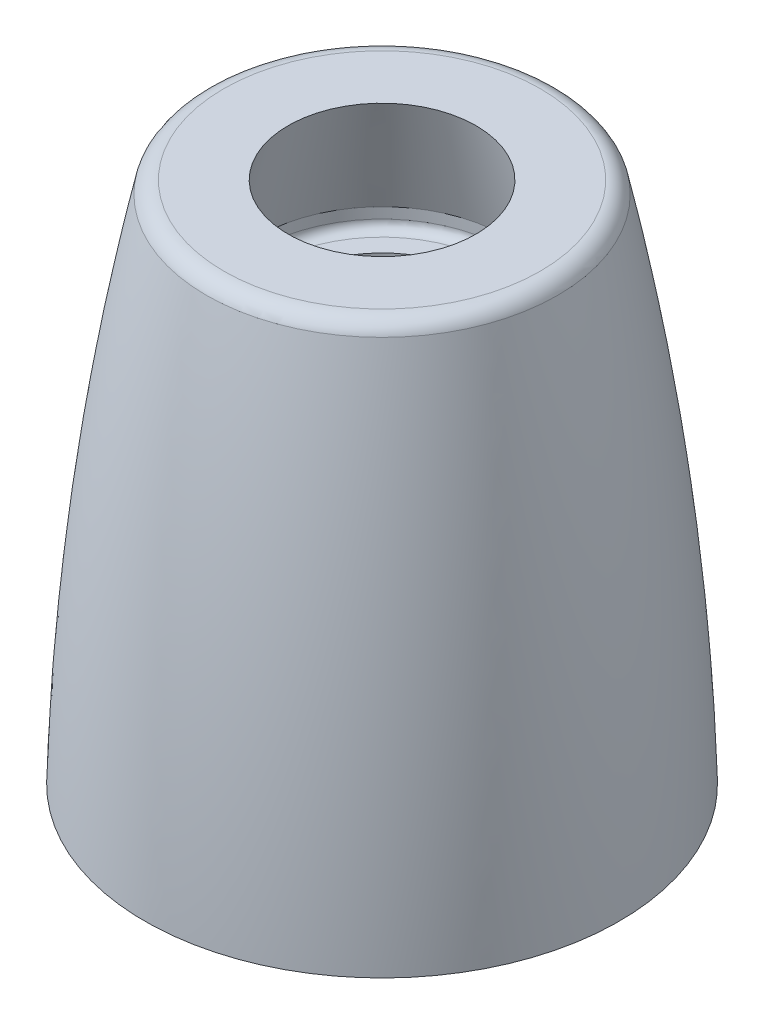
ISO-10303-21;
HEADER;
FILE_DESCRIPTION(('STEP AP214'),'2;1');
FILE_NAME('part.step','',(''),(''),'','','');
FILE_SCHEMA(('AUTOMOTIVE_DESIGN { 1 0 10303 214 1 1 1 1 }'));
ENDSEC;
DATA;
#1=APPLICATION_CONTEXT('core data for automotive mechanical design processes');
#2=APPLICATION_PROTOCOL_DEFINITION('international standard','automotive_design',2000,#1);
#3=PRODUCT_CONTEXT('',#1,'mechanical');
#4=PRODUCT('Part','Part','',(#3));
#5=PRODUCT_RELATED_PRODUCT_CATEGORY('part','',(#4));
#6=PRODUCT_DEFINITION_FORMATION('','',#4);
#7=PRODUCT_DEFINITION_CONTEXT('part definition',#1,'design');
#8=PRODUCT_DEFINITION('design','',#6,#7);
#9=PRODUCT_DEFINITION_SHAPE('','',#8);
#10=(LENGTH_UNIT() NAMED_UNIT(*) SI_UNIT(.MILLI.,.METRE.));
#11=(NAMED_UNIT(*) PLANE_ANGLE_UNIT() SI_UNIT($,.RADIAN.));
#12=(NAMED_UNIT(*) SI_UNIT($,.STERADIAN.) SOLID_ANGLE_UNIT());
#13=UNCERTAINTY_MEASURE_WITH_UNIT(LENGTH_MEASURE(1.E-05),#10,'distance_accuracy_value','');
#14=(GEOMETRIC_REPRESENTATION_CONTEXT(3) GLOBAL_UNCERTAINTY_ASSIGNED_CONTEXT((#13)) GLOBAL_UNIT_ASSIGNED_CONTEXT((#10,
#11,#12)) REPRESENTATION_CONTEXT('',''));
#15=CARTESIAN_POINT('',(0.,0.,0.));
#16=DIRECTION('',(0.,0.,1.));
#17=DIRECTION('',(1.,0.,0.));
#18=AXIS2_PLACEMENT_3D('',#15,#16,#17);
#19=CARTESIAN_POINT('',(6.23062,24.3246111856191,0.));
#20=DIRECTION('',(0.,1.,0.));
#21=DIRECTION('',(0.,0.,1.));
#22=AXIS2_PLACEMENT_3D('',#19,#20,#21);
#23=PLANE('',#22);
#24=CARTESIAN_POINT('',(0.,24.3246111856191,0.));
#25=DIRECTION('',(0.,-1.,0.));
#26=DIRECTION('',(0.,0.,-1.));
#27=AXIS2_PLACEMENT_3D('',#24,#25,#26);
#28=CIRCLE('',#27,6.23062);
#29=CARTESIAN_POINT('',(0.,24.3246111856191,6.23062));
#30=VERTEX_POINT('',#29);
#31=CARTESIAN_POINT('',(0.,24.3246111856191,-6.23062));
#32=VERTEX_POINT('',#31);
#33=EDGE_CURVE('E50',#30,#32,#28,.F.);
#34=ORIENTED_EDGE('',*,*,#33,.T.);
#35=CARTESIAN_POINT('',(0.,24.3246111856191,0.));
#36=DIRECTION('',(0.,-1.,0.));
#37=DIRECTION('',(0.,0.,1.));
#38=AXIS2_PLACEMENT_3D('',#35,#36,#37);
#39=CIRCLE('',#38,6.23062);
#40=EDGE_CURVE('E53',#32,#30,#39,.F.);
#41=ORIENTED_EDGE('',*,*,#40,.T.);
#42=EDGE_LOOP('',(#34,#41));
#43=FACE_BOUND('',#42,.T.);
#44=CARTESIAN_POINT('',(0.,24.3246111856191,0.));
#45=DIRECTION('',(0.,-1.,0.));
#46=DIRECTION('',(0.,0.,-1.));
#47=AXIS2_PLACEMENT_3D('',#44,#45,#46);
#48=CIRCLE('',#47,5.175);
#49=CARTESIAN_POINT('',(0.,24.3246111856191,-5.175));
#50=VERTEX_POINT('',#49);
#51=EDGE_CURVE('E58',#50,#50,#48,.T.);
#52=ORIENTED_EDGE('',*,*,#51,.T.);
#53=EDGE_LOOP('',(#52));
#54=FACE_BOUND('',#53,.T.);
#55=ADVANCED_FACE('F16',(#43,#54),#23,.T.);
#56=CARTESIAN_POINT('',(0.,24.8249911856191,0.));
#57=DIRECTION('',(0.,-1.,0.));
#58=DIRECTION('',(0.,0.,-1.));
#59=AXIS2_PLACEMENT_3D('',#56,#57,#58);
#60=TOROIDAL_SURFACE('',#59,6.23062,0.500380000000001);
#61=ORIENTED_EDGE('',*,*,#40,.F.);
#62=ORIENTED_EDGE('',*,*,#33,.F.);
#63=EDGE_LOOP('',(#61,#62));
#64=FACE_BOUND('',#63,.T.);
#65=CARTESIAN_POINT('',(0.,24.8249911856191,0.));
#66=DIRECTION('',(0.,-1.,0.));
#67=DIRECTION('',(0.,0.,-1.));
#68=AXIS2_PLACEMENT_3D('',#65,#66,#67);
#69=CIRCLE('',#68,6.731);
#70=CARTESIAN_POINT('',(0.,24.8249911856191,-6.731));
#71=VERTEX_POINT('',#70);
#72=EDGE_CURVE('E143',#71,#71,#69,.F.);
#73=ORIENTED_EDGE('',*,*,#72,.T.);
#74=EDGE_LOOP('',(#73));
#75=FACE_BOUND('',#74,.T.);
#76=ADVANCED_FACE('F61',(#64,#75),#60,.F.);
#77=CARTESIAN_POINT('',(0.,31.0037578537676,0.));
#78=DIRECTION('',(0.,-1.,0.));
#79=DIRECTION('',(0.,0.,-1.));
#80=AXIS2_PLACEMENT_3D('',#77,#78,#79);
#81=CYLINDRICAL_SURFACE('',#80,5.175);
#82=CARTESIAN_POINT('',(0.,15.7722628656191,0.));
#83=DIRECTION('',(0.,-1.,0.));
#84=DIRECTION('',(0.,0.,-1.));
#85=AXIS2_PLACEMENT_3D('',#82,#83,#84);
#86=CIRCLE('',#85,5.175);
#87=CARTESIAN_POINT('',(0.,15.7722628656191,-5.175));
#88=VERTEX_POINT('',#87);
#89=EDGE_CURVE('E142',#88,#88,#86,.F.);
#90=ORIENTED_EDGE('',*,*,#89,.F.);
#91=EDGE_LOOP('',(#90));
#92=FACE_BOUND('',#91,.T.);
#93=ORIENTED_EDGE('',*,*,#51,.F.);
#94=EDGE_LOOP('',(#93));
#95=FACE_BOUND('',#94,.T.);
#96=ADVANCED_FACE('F149',(#92,#95),#81,.F.);
#97=CARTESIAN_POINT('',(0.,31.0037578537676,0.));
#98=DIRECTION('',(0.,-1.,0.));
#99=DIRECTION('',(0.,0.,-1.));
#100=AXIS2_PLACEMENT_3D('',#97,#98,#99);
#101=CYLINDRICAL_SURFACE('',#100,6.731);
#102=ORIENTED_EDGE('',*,*,#72,.F.);
#103=EDGE_LOOP('',(#102));
#104=FACE_BOUND('',#103,.T.);
#105=CARTESIAN_POINT('',(0.,25.4097866327925,0.));
#106=DIRECTION('',(0.,-1.,0.));
#107=DIRECTION('',(0.,0.,-1.));
#108=AXIS2_PLACEMENT_3D('',#105,#106,#107);
#109=CIRCLE('',#108,6.73100000000204);
#110=CARTESIAN_POINT('',(0.,25.4097866327925,-6.73100000000204));
#111=VERTEX_POINT('',#110);
#112=EDGE_CURVE('E134',#111,#111,#109,.F.);
#113=ORIENTED_EDGE('',*,*,#112,.T.);
#114=EDGE_LOOP('',(#113));
#115=FACE_BOUND('',#114,.T.);
#116=ADVANCED_FACE('F117',(#104,#115),#101,.F.);
#117=CARTESIAN_POINT('',(5.175,15.7722628656191,0.));
#118=DIRECTION('',(0.,-1.,0.));
#119=DIRECTION('',(0.,0.,-1.));
#120=AXIS2_PLACEMENT_3D('',#117,#118,#119);
#121=PLANE('',#120);
#122=ORIENTED_EDGE('',*,*,#89,.T.);
#123=EDGE_LOOP('',(#122));
#124=FACE_BOUND('',#123,.T.);
#125=CARTESIAN_POINT('',(0.,15.7722628656191,0.));
#126=DIRECTION('',(0.,1.,0.));
#127=DIRECTION('',(0.,0.,1.));
#128=AXIS2_PLACEMENT_3D('',#125,#126,#127);
#129=CIRCLE('',#128,7.779);
#130=CARTESIAN_POINT('',(0.,15.7722628656191,-7.779));
#131=VERTEX_POINT('',#130);
#132=CARTESIAN_POINT('',(0.,15.7722628656191,7.779));
#133=VERTEX_POINT('',#132);
#134=EDGE_CURVE('E102',#131,#133,#129,.F.);
#135=ORIENTED_EDGE('',*,*,#134,.T.);
#136=CARTESIAN_POINT('',(0.,15.7722628656191,0.));
#137=DIRECTION('',(0.,1.,0.));
#138=DIRECTION('',(0.,0.,-1.));
#139=AXIS2_PLACEMENT_3D('',#136,#137,#138);
#140=CIRCLE('',#139,7.779);
#141=EDGE_CURVE('E130',#133,#131,#140,.F.);
#142=ORIENTED_EDGE('',*,*,#141,.T.);
#143=EDGE_LOOP('',(#135,#142));
#144=FACE_BOUND('',#143,.T.);
#145=ADVANCED_FACE('F108',(#124,#144),#121,.T.);
#146=CARTESIAN_POINT('',(0.,25.4097866327925,0.));
#147=DIRECTION('',(0.,-1.,0.));
#148=DIRECTION('',(0.,0.,-1.));
#149=AXIS2_PLACEMENT_3D('',#146,#147,#148);
#150=CONICAL_SURFACE('',#149,6.73100000000204,0.25960730001697);
#151=ORIENTED_EDGE('',*,*,#112,.F.);
#152=EDGE_LOOP('',(#151));
#153=FACE_BOUND('',#152,.T.);
#154=CARTESIAN_POINT('',(0.,31.4346111856594,0.));
#155=DIRECTION('',(0.,-1.,0.));
#156=DIRECTION('',(0.,0.,-1.));
#157=AXIS2_PLACEMENT_3D('',#154,#155,#156);
#158=CIRCLE('',#157,5.13079999998922);
#159=CARTESIAN_POINT('',(0.,31.4346111856594,-5.13079999998922));
#160=VERTEX_POINT('',#159);
#161=EDGE_CURVE('E163',#160,#160,#158,.T.);
#162=ORIENTED_EDGE('',*,*,#161,.F.);
#163=EDGE_LOOP('',(#162));
#164=FACE_BOUND('',#163,.T.);
#165=ADVANCED_FACE('F81',(#153,#164),#150,.F.);
#166=CARTESIAN_POINT('',(0.,13.7722628656191,0.));
#167=DIRECTION('',(0.,-1.,0.));
#168=DIRECTION('',(0.,0.,-1.));
#169=AXIS2_PLACEMENT_3D('',#166,#167,#168);
#170=TOROIDAL_SURFACE('',#169,7.779,2.);
#171=CARTESIAN_POINT('',(0.,13.7722628656191,0.));
#172=DIRECTION('',(0.,-1.,0.));
#173=DIRECTION('',(0.,0.,-1.));
#174=AXIS2_PLACEMENT_3D('',#171,#172,#173);
#175=CIRCLE('',#174,9.779);
#176=CARTESIAN_POINT('',(0.,13.7722628656191,-9.779));
#177=VERTEX_POINT('',#176);
#178=EDGE_CURVE('E95',#177,#177,#175,.T.);
#179=ORIENTED_EDGE('',*,*,#178,.T.);
#180=EDGE_LOOP('',(#179));
#181=FACE_BOUND('',#180,.T.);
#182=ORIENTED_EDGE('',*,*,#141,.F.);
#183=ORIENTED_EDGE('',*,*,#134,.F.);
#184=EDGE_LOOP('',(#182,#183));
#185=FACE_BOUND('',#184,.T.);
#186=ADVANCED_FACE('F69',(#181,#185),#170,.F.);
#187=CARTESIAN_POINT('',(8.63475526060741,31.4346111856191,0.));
#188=DIRECTION('',(0.,1.,0.));
#189=DIRECTION('',(0.,0.,1.));
#190=AXIS2_PLACEMENT_3D('',#187,#188,#189);
#191=PLANE('',#190);
#192=CARTESIAN_POINT('',(0.,31.4346111856191,0.));
#193=DIRECTION('',(0.,-1.,0.));
#194=DIRECTION('',(0.,0.,-1.));
#195=AXIS2_PLACEMENT_3D('',#192,#193,#194);
#196=CIRCLE('',#195,8.63475526060741);
#197=CARTESIAN_POINT('',(0.,31.4346111856191,-8.63475526060741));
#198=VERTEX_POINT('',#197);
#199=CARTESIAN_POINT('',(0.,31.4346111856191,8.63475526060741));
#200=VERTEX_POINT('',#199);
#201=EDGE_CURVE('E35',#198,#200,#196,.T.);
#202=ORIENTED_EDGE('',*,*,#201,.F.);
#203=CARTESIAN_POINT('',(0.,31.4346111856191,0.));
#204=DIRECTION('',(0.,-1.,0.));
#205=DIRECTION('',(0.,0.,1.));
#206=AXIS2_PLACEMENT_3D('',#203,#204,#205);
#207=CIRCLE('',#206,8.63475526060741);
#208=EDGE_CURVE('E98',#200,#198,#207,.T.);
#209=ORIENTED_EDGE('',*,*,#208,.F.);
#210=EDGE_LOOP('',(#202,#209));
#211=FACE_BOUND('',#210,.T.);
#212=ORIENTED_EDGE('',*,*,#161,.T.);
#213=EDGE_LOOP('',(#212));
#214=FACE_BOUND('',#213,.T.);
#215=ADVANCED_FACE('F80',(#211,#214),#191,.T.);
#216=CARTESIAN_POINT('',(0.,31.0037578537676,0.));
#217=DIRECTION('',(0.,-1.,0.));
#218=DIRECTION('',(0.,0.,-1.));
#219=AXIS2_PLACEMENT_3D('',#216,#217,#218);
#220=CYLINDRICAL_SURFACE('',#219,9.779);
#221=CARTESIAN_POINT('',(0.,2.85961118561913,0.));
#222=DIRECTION('',(0.,-1.,0.));
#223=DIRECTION('',(0.,0.,-1.));
#224=AXIS2_PLACEMENT_3D('',#221,#222,#223);
#225=CIRCLE('',#224,9.779);
#226=CARTESIAN_POINT('',(0.,2.85961118561913,-9.779));
#227=VERTEX_POINT('',#226);
#228=EDGE_CURVE('E160',#227,#227,#225,.F.);
#229=ORIENTED_EDGE('',*,*,#228,.F.);
#230=EDGE_LOOP('',(#229));
#231=FACE_BOUND('',#230,.T.);
#232=ORIENTED_EDGE('',*,*,#178,.F.);
#233=EDGE_LOOP('',(#232));
#234=FACE_BOUND('',#233,.T.);
#235=ADVANCED_FACE('F184',(#231,#234),#220,.F.);
#236=CARTESIAN_POINT('',(0.,30.4346111856202,0.));
#237=DIRECTION('',(0.,-1.,0.));
#238=DIRECTION('',(0.,0.,-1.));
#239=AXIS2_PLACEMENT_3D('',#236,#237,#238);
#240=TOROIDAL_SURFACE('',#239,8.63475526060741,0.999999999998937);
#241=ORIENTED_EDGE('',*,*,#201,.T.);
#242=ORIENTED_EDGE('',*,*,#208,.T.);
#243=EDGE_LOOP('',(#241,#242));
#244=FACE_BOUND('',#243,.T.);
#245=CARTESIAN_POINT('',(0.,30.7624474661682,0.));
#246=DIRECTION('',(0.,-1.,0.));
#247=DIRECTION('',(0.,0.,-1.));
#248=AXIS2_PLACEMENT_3D('',#245,#246,#247);
#249=CIRCLE('',#248,9.57948981229606);
#250=CARTESIAN_POINT('',(0.,30.7624474661682,-9.57948981229606));
#251=VERTEX_POINT('',#250);
#252=EDGE_CURVE('E27',#251,#251,#249,.T.);
#253=ORIENTED_EDGE('',*,*,#252,.F.);
#254=EDGE_LOOP('',(#253));
#255=FACE_BOUND('',#254,.T.);
#256=ADVANCED_FACE('F173',(#244,#255),#240,.T.);
#257=CARTESIAN_POINT('',(9.779,2.85961118561911,0.));
#258=DIRECTION('',(0.,-1.,0.));
#259=DIRECTION('',(0.,0.,-1.));
#260=AXIS2_PLACEMENT_3D('',#257,#258,#259);
#261=PLANE('',#260);
#262=ORIENTED_EDGE('',*,*,#228,.T.);
#263=EDGE_LOOP('',(#262));
#264=FACE_BOUND('',#263,.T.);
#265=CARTESIAN_POINT('',(0.,2.85961118561912,0.));
#266=DIRECTION('',(0.,-1.,0.));
#267=DIRECTION('',(0.,0.,-1.));
#268=AXIS2_PLACEMENT_3D('',#265,#266,#267);
#269=CIRCLE('',#268,12.9487371025054);
#270=CARTESIAN_POINT('',(0.,2.85961118561912,-12.9487371025054));
#271=VERTEX_POINT('',#270);
#272=EDGE_CURVE('E11',#271,#271,#269,.F.);
#273=ORIENTED_EDGE('',*,*,#272,.F.);
#274=EDGE_LOOP('',(#273));
#275=FACE_BOUND('',#274,.T.);
#276=ADVANCED_FACE('F183',(#264,#275),#261,.T.);
#277=CARTESIAN_POINT('',(0.,-1.20724054969762,137.956407060144));
#278=DIRECTION('',(1.,0.,0.));
#279=DIRECTION('',(0.,0.,-1.));
#280=AXIS2_PLACEMENT_3D('',#277,#278,#279);
#281=CIRCLE('',#280,150.959934478613);
#282=TRIMMED_CURVE('',#281,(PARAMETER_VALUE(-0.418102383685094)),
(PARAMETER_VALUE(0.418102383685094)),.T.,.PARAMETER.);
#283=CARTESIAN_POINT('',(0.,-1.20724054969762,0.));
#284=DIRECTION('',(0.,-1.,0.));
#285=AXIS1_PLACEMENT('',#283,#284);
#286=SURFACE_OF_REVOLUTION('',#282,#285);
#287=ORIENTED_EDGE('',*,*,#252,.T.);
#288=EDGE_LOOP('',(#287));
#289=FACE_BOUND('',#288,.T.);
#290=ORIENTED_EDGE('',*,*,#272,.T.);
#291=EDGE_LOOP('',(#290));
#292=FACE_BOUND('',#291,.T.);
#293=ADVANCED_FACE('F211',(#289,#292),#286,.F.);
#294=CLOSED_SHELL('',(#55,#76,#96,#116,#145,#165,#186,#215,#235,#256,#276,#293));
#295=MANIFOLD_SOLID_BREP('B1',#294);
#296=ADVANCED_BREP_SHAPE_REPRESENTATION('',(#18,#295),#14);
#297=SHAPE_DEFINITION_REPRESENTATION(#9,#296);
ENDSEC;
END-ISO-10303-21;
